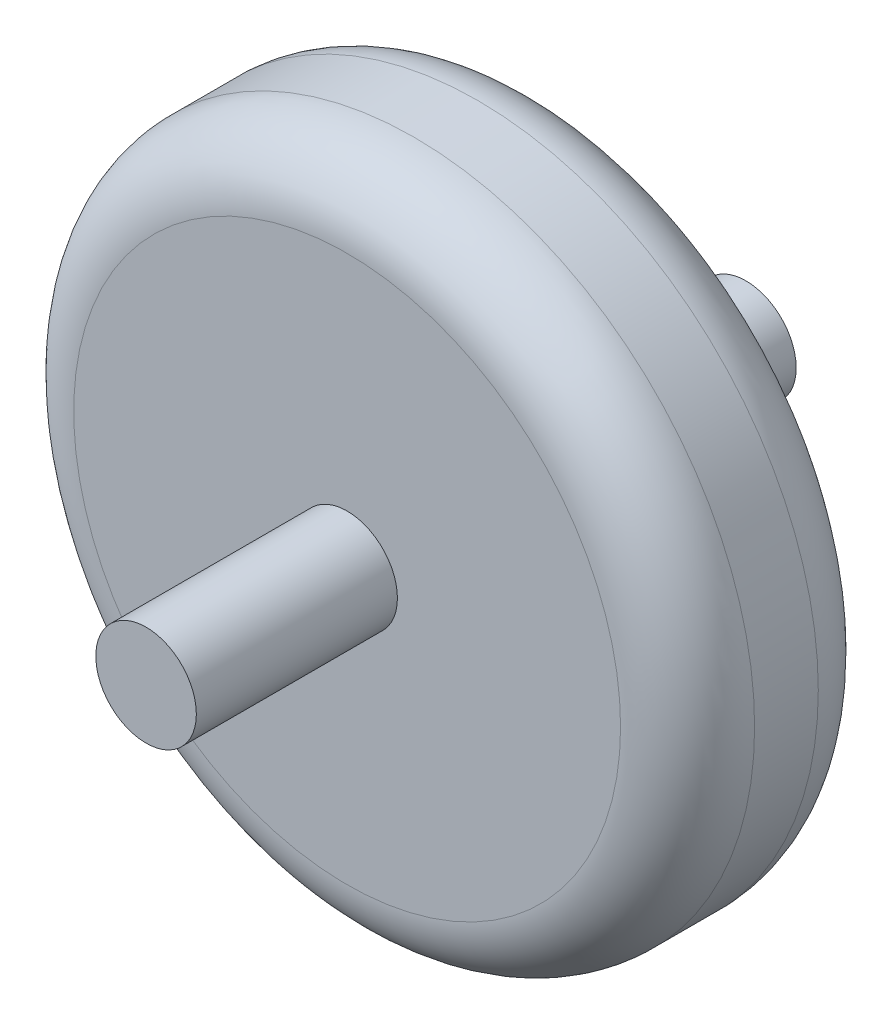
ISO-10303-21;
HEADER;
FILE_DESCRIPTION(('STEP AP214'),'2;1');
FILE_NAME('part.step','',(''),(''),'','','');
FILE_SCHEMA(('AUTOMOTIVE_DESIGN { 1 0 10303 214 1 1 1 1 }'));
ENDSEC;
DATA;
#1=APPLICATION_CONTEXT('core data for automotive mechanical design processes');
#2=APPLICATION_PROTOCOL_DEFINITION('international standard','automotive_design',2000,#1);
#3=PRODUCT_CONTEXT('',#1,'mechanical');
#4=PRODUCT('Part','Part','',(#3));
#5=PRODUCT_RELATED_PRODUCT_CATEGORY('part','',(#4));
#6=PRODUCT_DEFINITION_FORMATION('','',#4);
#7=PRODUCT_DEFINITION_CONTEXT('part definition',#1,'design');
#8=PRODUCT_DEFINITION('design','',#6,#7);
#9=PRODUCT_DEFINITION_SHAPE('','',#8);
#10=(LENGTH_UNIT() NAMED_UNIT(*) SI_UNIT(.MILLI.,.METRE.));
#11=(NAMED_UNIT(*) PLANE_ANGLE_UNIT() SI_UNIT($,.RADIAN.));
#12=(NAMED_UNIT(*) SI_UNIT($,.STERADIAN.) SOLID_ANGLE_UNIT());
#13=UNCERTAINTY_MEASURE_WITH_UNIT(LENGTH_MEASURE(1.E-05),#10,'distance_accuracy_value','');
#14=(GEOMETRIC_REPRESENTATION_CONTEXT(3) GLOBAL_UNCERTAINTY_ASSIGNED_CONTEXT((#13)) GLOBAL_UNIT_ASSIGNED_CONTEXT((#10,
#11,#12)) REPRESENTATION_CONTEXT('',''));
#15=CARTESIAN_POINT('',(0.,0.,0.));
#16=DIRECTION('',(0.,0.,1.));
#17=DIRECTION('',(1.,0.,0.));
#18=AXIS2_PLACEMENT_3D('',#15,#16,#17);
#19=CARTESIAN_POINT('',(0.,0.,59.));
#20=DIRECTION('',(0.,0.,-1.));
#21=DIRECTION('',(-1.,0.,0.));
#22=AXIS2_PLACEMENT_3D('',#19,#20,#21);
#23=CYLINDRICAL_SURFACE('',#22,101.6);
#24=CARTESIAN_POINT('',(0.,0.,39.));
#25=DIRECTION('',(0.,0.,1.));
#26=DIRECTION('',(1.,0.,0.));
#27=AXIS2_PLACEMENT_3D('',#24,#25,#26);
#28=CIRCLE('',#27,101.6);
#29=CARTESIAN_POINT('',(101.6,0.,39.));
#30=VERTEX_POINT('',#29);
#31=EDGE_CURVE('E58',#30,#30,#28,.F.);
#32=ORIENTED_EDGE('',*,*,#31,.T.);
#33=EDGE_LOOP('',(#32));
#34=FACE_BOUND('',#33,.T.);
#35=CARTESIAN_POINT('',(0.,0.,20.));
#36=DIRECTION('',(0.,0.,1.));
#37=DIRECTION('',(1.,0.,0.));
#38=AXIS2_PLACEMENT_3D('',#35,#36,#37);
#39=CIRCLE('',#38,101.6);
#40=CARTESIAN_POINT('',(101.6,0.,20.));
#41=VERTEX_POINT('',#40);
#42=EDGE_CURVE('E67',#41,#41,#39,.T.);
#43=ORIENTED_EDGE('',*,*,#42,.T.);
#44=EDGE_LOOP('',(#43));
#45=FACE_BOUND('',#44,.T.);
#46=ADVANCED_FACE('F43',(#34,#45),#23,.T.);
#47=CARTESIAN_POINT('',(0.,0.,59.));
#48=DIRECTION('',(0.,0.,1.));
#49=DIRECTION('',(1.,0.,0.));
#50=AXIS2_PLACEMENT_3D('',#47,#48,#49);
#51=PLANE('',#50);
#52=CARTESIAN_POINT('',(0.,0.,59.));
#53=DIRECTION('',(0.,0.,1.));
#54=DIRECTION('',(1.,0.,0.));
#55=AXIS2_PLACEMENT_3D('',#52,#53,#54);
#56=CIRCLE('',#55,15.);
#57=CARTESIAN_POINT('',(15.,0.,59.));
#58=VERTEX_POINT('',#57);
#59=EDGE_CURVE('E10',#58,#58,#56,.T.);
#60=ORIENTED_EDGE('',*,*,#59,.F.);
#61=EDGE_LOOP('',(#60));
#62=FACE_BOUND('',#61,.T.);
#63=CARTESIAN_POINT('',(0.,0.,59.));
#64=DIRECTION('',(0.,0.,1.));
#65=DIRECTION('',(1.,0.,0.));
#66=AXIS2_PLACEMENT_3D('',#63,#64,#65);
#67=CIRCLE('',#66,81.6);
#68=CARTESIAN_POINT('',(81.6,0.,59.));
#69=VERTEX_POINT('',#68);
#70=EDGE_CURVE('E63',#69,#69,#67,.T.);
#71=ORIENTED_EDGE('',*,*,#70,.T.);
#72=EDGE_LOOP('',(#71));
#73=FACE_BOUND('',#72,.T.);
#74=ADVANCED_FACE('F83',(#62,#73),#51,.T.);
#75=CARTESIAN_POINT('',(0.,0.,0.));
#76=DIRECTION('',(0.,0.,1.));
#77=DIRECTION('',(1.,0.,0.));
#78=AXIS2_PLACEMENT_3D('',#75,#76,#77);
#79=PLANE('',#78);
#80=CARTESIAN_POINT('',(0.,0.,0.));
#81=DIRECTION('',(0.,0.,1.));
#82=DIRECTION('',(1.,0.,0.));
#83=AXIS2_PLACEMENT_3D('',#80,#81,#82);
#84=CIRCLE('',#83,15.);
#85=CARTESIAN_POINT('',(15.,0.,0.));
#86=VERTEX_POINT('',#85);
#87=EDGE_CURVE('E47',#86,#86,#84,.T.);
#88=ORIENTED_EDGE('',*,*,#87,.T.);
#89=EDGE_LOOP('',(#88));
#90=FACE_BOUND('',#89,.T.);
#91=CARTESIAN_POINT('',(0.,0.,0.));
#92=DIRECTION('',(0.,0.,1.));
#93=DIRECTION('',(1.,0.,0.));
#94=AXIS2_PLACEMENT_3D('',#91,#92,#93);
#95=CIRCLE('',#94,81.6);
#96=CARTESIAN_POINT('',(81.6,0.,0.));
#97=VERTEX_POINT('',#96);
#98=EDGE_CURVE('E52',#97,#97,#95,.F.);
#99=ORIENTED_EDGE('',*,*,#98,.T.);
#100=EDGE_LOOP('',(#99));
#101=FACE_BOUND('',#100,.T.);
#102=ADVANCED_FACE('F80',(#90,#101),#79,.F.);
#103=CARTESIAN_POINT('',(0.,0.,39.));
#104=DIRECTION('',(0.,0.,1.));
#105=DIRECTION('',(1.,0.,0.));
#106=AXIS2_PLACEMENT_3D('',#103,#104,#105);
#107=TOROIDAL_SURFACE('',#106,81.6,20.);
#108=ORIENTED_EDGE('',*,*,#31,.F.);
#109=EDGE_LOOP('',(#108));
#110=FACE_BOUND('',#109,.T.);
#111=ORIENTED_EDGE('',*,*,#70,.F.);
#112=EDGE_LOOP('',(#111));
#113=FACE_BOUND('',#112,.T.);
#114=ADVANCED_FACE('F77',(#110,#113),#107,.T.);
#115=CARTESIAN_POINT('',(0.,0.,20.));
#116=DIRECTION('',(0.,0.,1.));
#117=DIRECTION('',(1.,0.,0.));
#118=AXIS2_PLACEMENT_3D('',#115,#116,#117);
#119=TOROIDAL_SURFACE('',#118,81.6,20.);
#120=ORIENTED_EDGE('',*,*,#98,.F.);
#121=EDGE_LOOP('',(#120));
#122=FACE_BOUND('',#121,.T.);
#123=ORIENTED_EDGE('',*,*,#42,.F.);
#124=EDGE_LOOP('',(#123));
#125=FACE_BOUND('',#124,.T.);
#126=ADVANCED_FACE('F45',(#122,#125),#119,.T.);
#127=CARTESIAN_POINT('',(0.,0.,-60.));
#128=DIRECTION('',(0.,0.,1.));
#129=DIRECTION('',(1.,0.,0.));
#130=AXIS2_PLACEMENT_3D('',#127,#128,#129);
#131=PLANE('',#130);
#132=CARTESIAN_POINT('',(0.,0.,-60.));
#133=DIRECTION('',(0.,0.,1.));
#134=DIRECTION('',(1.,0.,0.));
#135=AXIS2_PLACEMENT_3D('',#132,#133,#134);
#136=CIRCLE('',#135,15.);
#137=CARTESIAN_POINT('',(15.,0.,-60.));
#138=VERTEX_POINT('',#137);
#139=EDGE_CURVE('E61',#138,#138,#136,.T.);
#140=ORIENTED_EDGE('',*,*,#139,.F.);
#141=EDGE_LOOP('',(#140));
#142=FACE_BOUND('',#141,.T.);
#143=ADVANCED_FACE('F101',(#142),#131,.F.);
#144=CARTESIAN_POINT('',(0.,0.,-60.));
#145=DIRECTION('',(0.,0.,1.));
#146=DIRECTION('',(1.,0.,0.));
#147=AXIS2_PLACEMENT_3D('',#144,#145,#146);
#148=CYLINDRICAL_SURFACE('',#147,15.);
#149=ORIENTED_EDGE('',*,*,#139,.T.);
#150=EDGE_LOOP('',(#149));
#151=FACE_BOUND('',#150,.T.);
#152=ORIENTED_EDGE('',*,*,#87,.F.);
#153=EDGE_LOOP('',(#152));
#154=FACE_BOUND('',#153,.T.);
#155=ADVANCED_FACE('F100',(#151,#154),#148,.T.);
#156=ORIENTED_EDGE('',*,*,#59,.T.);
#157=EDGE_LOOP('',(#156));
#158=FACE_BOUND('',#157,.T.);
#159=CARTESIAN_POINT('',(0.,0.,119.));
#160=DIRECTION('',(0.,0.,1.));
#161=DIRECTION('',(1.,0.,0.));
#162=AXIS2_PLACEMENT_3D('',#159,#160,#161);
#163=CIRCLE('',#162,15.);
#164=CARTESIAN_POINT('',(15.,0.,119.));
#165=VERTEX_POINT('',#164);
#166=EDGE_CURVE('E111',#165,#165,#163,.T.);
#167=ORIENTED_EDGE('',*,*,#166,.F.);
#168=EDGE_LOOP('',(#167));
#169=FACE_BOUND('',#168,.T.);
#170=ADVANCED_FACE('F96',(#158,#169),#148,.T.);
#171=CARTESIAN_POINT('',(0.,0.,119.));
#172=DIRECTION('',(0.,0.,1.));
#173=DIRECTION('',(1.,0.,0.));
#174=AXIS2_PLACEMENT_3D('',#171,#172,#173);
#175=PLANE('',#174);
#176=ORIENTED_EDGE('',*,*,#166,.T.);
#177=EDGE_LOOP('',(#176));
#178=FACE_BOUND('',#177,.T.);
#179=ADVANCED_FACE('F99',(#178),#175,.T.);
#180=CLOSED_SHELL('',(#46,#74,#102,#114,#126,#143,#155,#170,#179));
#181=MANIFOLD_SOLID_BREP('B2',#180);
#182=ADVANCED_BREP_SHAPE_REPRESENTATION('',(#18,#181),#14);
#183=SHAPE_DEFINITION_REPRESENTATION(#9,#182);
ENDSEC;
END-ISO-10303-21;
